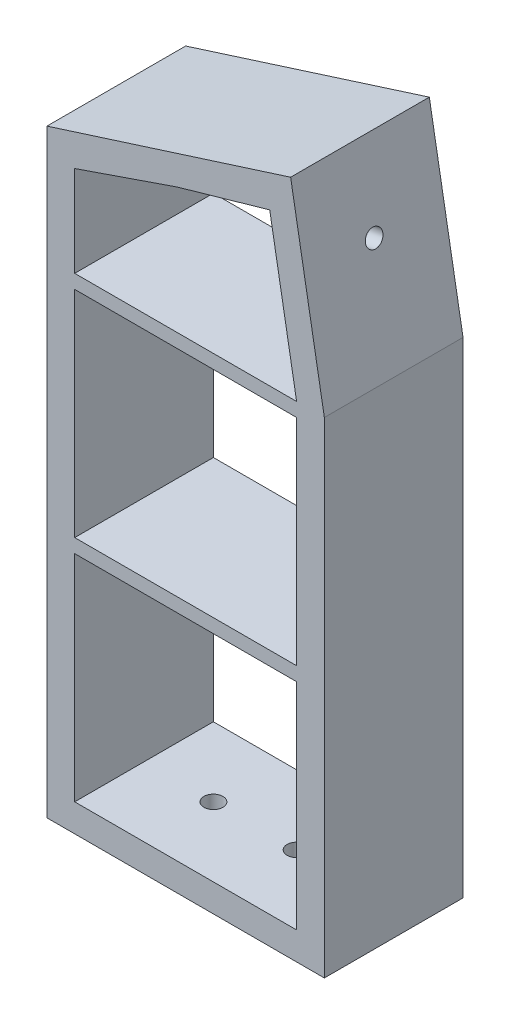
ISO-10303-21;
HEADER;
FILE_DESCRIPTION(('STEP AP214'),'2;1');
FILE_NAME('part.step','',(''),(''),'','','');
FILE_SCHEMA(('AUTOMOTIVE_DESIGN { 1 0 10303 214 1 1 1 1 }'));
ENDSEC;
DATA;
#1=APPLICATION_CONTEXT('core data for automotive mechanical design processes');
#2=APPLICATION_PROTOCOL_DEFINITION('international standard','automotive_design',2000,#1);
#3=PRODUCT_CONTEXT('',#1,'mechanical');
#4=PRODUCT('Part','Part','',(#3));
#5=PRODUCT_RELATED_PRODUCT_CATEGORY('part','',(#4));
#6=PRODUCT_DEFINITION_FORMATION('','',#4);
#7=PRODUCT_DEFINITION_CONTEXT('part definition',#1,'design');
#8=PRODUCT_DEFINITION('design','',#6,#7);
#9=PRODUCT_DEFINITION_SHAPE('','',#8);
#10=(LENGTH_UNIT() NAMED_UNIT(*) SI_UNIT(.MILLI.,.METRE.));
#11=(NAMED_UNIT(*) PLANE_ANGLE_UNIT() SI_UNIT($,.RADIAN.));
#12=(NAMED_UNIT(*) SI_UNIT($,.STERADIAN.) SOLID_ANGLE_UNIT());
#13=UNCERTAINTY_MEASURE_WITH_UNIT(LENGTH_MEASURE(1.E-05),#10,'distance_accuracy_value','');
#14=(GEOMETRIC_REPRESENTATION_CONTEXT(3) GLOBAL_UNCERTAINTY_ASSIGNED_CONTEXT((#13)) GLOBAL_UNIT_ASSIGNED_CONTEXT((#10,
#11,#12)) REPRESENTATION_CONTEXT('',''));
#15=CARTESIAN_POINT('',(0.,0.,0.));
#16=DIRECTION('',(0.,0.,1.));
#17=DIRECTION('',(1.,0.,0.));
#18=AXIS2_PLACEMENT_3D('',#15,#16,#17);
#19=CARTESIAN_POINT('',(-30.8690259824049,207.731789578758,50.));
#20=DIRECTION('',(1.,0.,0.));
#21=DIRECTION('',(0.,1.,0.));
#22=AXIS2_PLACEMENT_3D('',#19,#20,#21);
#23=PLANE('',#22);
#24=DIRECTION('',(0.,0.,1.));
#25=VECTOR('',#24,1.);
#26=CARTESIAN_POINT('',(-30.8690259824049,175.,0.));
#27=LINE('',#26,#25);
#28=CARTESIAN_POINT('',(-30.8690259824049,175.,0.));
#29=VERTEX_POINT('',#28);
#30=CARTESIAN_POINT('',(-30.8690259824049,175.,50.));
#31=VERTEX_POINT('',#30);
#32=EDGE_CURVE('E682',#29,#31,#27,.T.);
#33=ORIENTED_EDGE('',*,*,#32,.F.);
#34=DIRECTION('',(0.,-1.,0.));
#35=VECTOR('',#34,1.);
#36=CARTESIAN_POINT('',(-30.8690259824049,207.731789578758,0.));
#37=LINE('',#36,#35);
#38=CARTESIAN_POINT('',(-30.8690259824049,207.731789578758,0.));
#39=VERTEX_POINT('',#38);
#40=EDGE_CURVE('E296',#39,#29,#37,.T.);
#41=ORIENTED_EDGE('',*,*,#40,.F.);
#42=DIRECTION('',(0.,0.,-1.));
#43=VECTOR('',#42,1.);
#44=CARTESIAN_POINT('',(-30.8690259824049,207.731789578758,50.));
#45=LINE('',#44,#43);
#46=CARTESIAN_POINT('',(-30.8690259824049,207.731789578758,50.));
#47=VERTEX_POINT('',#46);
#48=EDGE_CURVE('E273',#47,#39,#45,.T.);
#49=ORIENTED_EDGE('',*,*,#48,.F.);
#50=DIRECTION('',(0.,-1.,0.));
#51=VECTOR('',#50,1.);
#52=CARTESIAN_POINT('',(-30.8690259824049,107.98972636841,50.));
#53=LINE('',#52,#51);
#54=EDGE_CURVE('E180',#47,#31,#53,.T.);
#55=ORIENTED_EDGE('',*,*,#54,.T.);
#56=EDGE_LOOP('',(#33,#41,#49,#55));
#57=FACE_BOUND('',#56,.T.);
#58=ADVANCED_FACE('F43',(#57),#23,.T.);
#59=CARTESIAN_POINT('',(49.130974017595,87.5,50.));
#60=DIRECTION('',(-1.,0.,0.));
#61=DIRECTION('',(0.,0.,1.));
#62=AXIS2_PLACEMENT_3D('',#59,#60,#61);
#63=PLANE('',#62);
#64=DIRECTION('',(0.,0.,1.));
#65=VECTOR('',#64,1.);
#66=CARTESIAN_POINT('',(49.130974017595,87.5,0.));
#67=LINE('',#66,#65);
#68=CARTESIAN_POINT('',(49.130974017595,87.5,0.));
#69=VERTEX_POINT('',#68);
#70=CARTESIAN_POINT('',(49.130974017595,87.5,50.));
#71=VERTEX_POINT('',#70);
#72=EDGE_CURVE('E223',#69,#71,#67,.T.);
#73=ORIENTED_EDGE('',*,*,#72,.F.);
#74=DIRECTION('',(0.,1.,0.));
#75=VECTOR('',#74,1.);
#76=CARTESIAN_POINT('',(49.130974017595,87.5,0.));
#77=LINE('',#76,#75);
#78=CARTESIAN_POINT('',(49.130974017595,10.,0.));
#79=VERTEX_POINT('',#78);
#80=EDGE_CURVE('E279',#79,#69,#77,.T.);
#81=ORIENTED_EDGE('',*,*,#80,.F.);
#82=DIRECTION('',(0.,0.,-1.));
#83=VECTOR('',#82,1.);
#84=CARTESIAN_POINT('',(49.130974017595,10.,50.));
#85=LINE('',#84,#83);
#86=CARTESIAN_POINT('',(49.130974017595,10.,50.));
#87=VERTEX_POINT('',#86);
#88=EDGE_CURVE('E312',#87,#79,#85,.T.);
#89=ORIENTED_EDGE('',*,*,#88,.F.);
#90=DIRECTION('',(0.,1.,0.));
#91=VECTOR('',#90,1.);
#92=CARTESIAN_POINT('',(49.130974017595,10.,50.));
#93=LINE('',#92,#91);
#94=EDGE_CURVE('E260',#87,#71,#93,.T.);
#95=ORIENTED_EDGE('',*,*,#94,.T.);
#96=EDGE_LOOP('',(#73,#81,#89,#95));
#97=FACE_BOUND('',#96,.T.);
#98=ADVANCED_FACE('F402',(#97),#63,.T.);
#99=DIRECTION('',(0.,0.,1.));
#100=VECTOR('',#99,1.);
#101=CARTESIAN_POINT('',(-30.8690259824049,87.5,0.));
#102=LINE('',#101,#100);
#103=CARTESIAN_POINT('',(-30.8690259824049,87.5,0.));
#104=VERTEX_POINT('',#103);
#105=CARTESIAN_POINT('',(-30.8690259824049,87.5,50.));
#106=VERTEX_POINT('',#105);
#107=EDGE_CURVE('E228',#104,#106,#102,.T.);
#108=ORIENTED_EDGE('',*,*,#107,.T.);
#109=CARTESIAN_POINT('',(-30.869025982405,10.,50.));
#110=VERTEX_POINT('',#109);
#111=EDGE_CURVE('E181',#106,#110,#53,.T.);
#112=ORIENTED_EDGE('',*,*,#111,.T.);
#113=DIRECTION('',(0.,0.,-1.));
#114=VECTOR('',#113,1.);
#115=CARTESIAN_POINT('',(-30.869025982405,10.,50.));
#116=LINE('',#115,#114);
#117=CARTESIAN_POINT('',(-30.8690259824049,10.,0.));
#118=VERTEX_POINT('',#117);
#119=EDGE_CURVE('E316',#110,#118,#116,.T.);
#120=ORIENTED_EDGE('',*,*,#119,.T.);
#121=EDGE_CURVE('E295',#104,#118,#37,.T.);
#122=ORIENTED_EDGE('',*,*,#121,.F.);
#123=EDGE_LOOP('',(#108,#112,#120,#122));
#124=FACE_BOUND('',#123,.T.);
#125=ADVANCED_FACE('F405',(#124),#23,.T.);
#126=CARTESIAN_POINT('',(0.,0.,50.));
#127=DIRECTION('',(0.,0.,1.));
#128=DIRECTION('',(1.,0.,0.));
#129=AXIS2_PLACEMENT_3D('',#126,#127,#128);
#130=PLANE('',#129);
#131=DIRECTION('',(-0.173648177666931,0.984807753012208,0.));
#132=VECTOR('',#131,1.);
#133=CARTESIAN_POINT('',(49.130974017595,175.,50.));
#134=LINE('',#133,#132);
#135=CARTESIAN_POINT('',(49.130974017595,175.,50.));
#136=VERTEX_POINT('',#135);
#137=CARTESIAN_POINT('',(39.440396213168,229.957997723837,50.));
#138=VERTEX_POINT('',#137);
#139=EDGE_CURVE('E263',#136,#138,#134,.T.);
#140=ORIENTED_EDGE('',*,*,#139,.F.);
#141=DIRECTION('',(-1.,0.,0.));
#142=VECTOR('',#141,1.);
#143=CARTESIAN_POINT('',(49.130974017595,175.,50.));
#144=LINE('',#143,#142);
#145=EDGE_CURVE('E195',#136,#31,#144,.T.);
#146=ORIENTED_EDGE('',*,*,#145,.T.);
#147=ORIENTED_EDGE('',*,*,#54,.F.);
#148=DIRECTION('',(-0.945734769141537,-0.324939604291019,0.));
#149=VECTOR('',#148,1.);
#150=CARTESIAN_POINT('',(6.08596726535605,220.428944504557,50.));
#151=LINE('',#150,#149);
#152=CARTESIAN_POINT('',(6.08596726535605,220.428944504557,50.));
#153=VERTEX_POINT('',#152);
#154=EDGE_CURVE('E269',#153,#47,#151,.T.);
#155=ORIENTED_EDGE('',*,*,#154,.F.);
#156=DIRECTION('',(-0.961529914586664,-0.274700242728255,0.));
#157=VECTOR('',#156,1.);
#158=CARTESIAN_POINT('',(39.440396213168,229.957997723837,50.));
#159=LINE('',#158,#157);
#160=EDGE_CURVE('E266',#138,#153,#159,.T.);
#161=ORIENTED_EDGE('',*,*,#160,.F.);
#162=EDGE_LOOP('',(#140,#146,#147,#155,#161));
#163=FACE_BOUND('',#162,.T.);
#164=CARTESIAN_POINT('',(49.130974017595,92.5,50.));
#165=VERTEX_POINT('',#164);
#166=CARTESIAN_POINT('',(49.1309740175949,170.,50.));
#167=VERTEX_POINT('',#166);
#168=EDGE_CURVE('E65',#165,#167,#93,.T.);
#169=ORIENTED_EDGE('',*,*,#168,.F.);
#170=DIRECTION('',(-1.,0.,0.));
#171=VECTOR('',#170,1.);
#172=CARTESIAN_POINT('',(49.130974017595,92.5,50.));
#173=LINE('',#172,#171);
#174=CARTESIAN_POINT('',(-30.8690259824049,92.5,50.));
#175=VERTEX_POINT('',#174);
#176=EDGE_CURVE('E175',#165,#175,#173,.T.);
#177=ORIENTED_EDGE('',*,*,#176,.T.);
#178=CARTESIAN_POINT('',(-30.8690259824049,170.,50.));
#179=VERTEX_POINT('',#178);
#180=EDGE_CURVE('E168',#179,#175,#53,.T.);
#181=ORIENTED_EDGE('',*,*,#180,.F.);
#182=DIRECTION('',(1.,0.,0.));
#183=VECTOR('',#182,1.);
#184=CARTESIAN_POINT('',(49.130974017595,170.,50.));
#185=LINE('',#184,#183);
#186=EDGE_CURVE('E173',#179,#167,#185,.T.);
#187=ORIENTED_EDGE('',*,*,#186,.T.);
#188=EDGE_LOOP('',(#169,#177,#181,#187));
#189=FACE_BOUND('',#188,.T.);
#190=DIRECTION('',(-0.173648177666931,0.984807753012208,0.));
#191=VECTOR('',#190,1.);
#192=CARTESIAN_POINT('',(59.130974017595,175.,50.));
#193=LINE('',#192,#191);
#194=CARTESIAN_POINT('',(59.130974017595,175.,50.));
#195=VERTEX_POINT('',#194);
#196=CARTESIAN_POINT('',(46.9756015809098,243.936542710855,50.));
#197=VERTEX_POINT('',#196);
#198=EDGE_CURVE('E321',#195,#197,#193,.T.);
#199=ORIENTED_EDGE('',*,*,#198,.T.);
#200=DIRECTION('',(-0.952905321928016,-0.30326794661036,0.));
#201=VECTOR('',#200,1.);
#202=CARTESIAN_POINT('',(46.9756015809098,243.936542710855,50.));
#203=LINE('',#202,#201);
#204=CARTESIAN_POINT('',(-40.869025982405,215.97945273682,50.));
#205=VERTEX_POINT('',#204);
#206=EDGE_CURVE('E325',#197,#205,#203,.T.);
#207=ORIENTED_EDGE('',*,*,#206,.T.);
#208=DIRECTION('',(0.,-1.,0.));
#209=VECTOR('',#208,1.);
#210=CARTESIAN_POINT('',(-40.869025982405,215.97945273682,50.));
#211=LINE('',#210,#209);
#212=CARTESIAN_POINT('',(-40.869025982405,0.,50.));
#213=VERTEX_POINT('',#212);
#214=EDGE_CURVE('E329',#205,#213,#211,.T.);
#215=ORIENTED_EDGE('',*,*,#214,.T.);
#216=DIRECTION('',(1.,0.,0.));
#217=VECTOR('',#216,1.);
#218=CARTESIAN_POINT('',(-40.869025982405,0.,50.));
#219=LINE('',#218,#217);
#220=CARTESIAN_POINT('',(59.130974017595,0.,50.));
#221=VERTEX_POINT('',#220);
#222=EDGE_CURVE('E332',#213,#221,#219,.T.);
#223=ORIENTED_EDGE('',*,*,#222,.T.);
#224=DIRECTION('',(0.,1.,0.));
#225=VECTOR('',#224,1.);
#226=CARTESIAN_POINT('',(59.130974017595,0.,50.));
#227=LINE('',#226,#225);
#228=EDGE_CURVE('E335',#221,#195,#227,.T.);
#229=ORIENTED_EDGE('',*,*,#228,.T.);
#230=EDGE_LOOP('',(#199,#207,#215,#223,#229));
#231=FACE_BOUND('',#230,.T.);
#232=ORIENTED_EDGE('',*,*,#94,.F.);
#233=DIRECTION('',(1.,0.,0.));
#234=VECTOR('',#233,1.);
#235=CARTESIAN_POINT('',(-30.869025982405,10.,50.));
#236=LINE('',#235,#234);
#237=EDGE_CURVE('E257',#110,#87,#236,.T.);
#238=ORIENTED_EDGE('',*,*,#237,.F.);
#239=ORIENTED_EDGE('',*,*,#111,.F.);
#240=DIRECTION('',(1.,0.,0.));
#241=VECTOR('',#240,1.);
#242=CARTESIAN_POINT('',(49.130974017595,87.5,50.));
#243=LINE('',#242,#241);
#244=EDGE_CURVE('E199',#106,#71,#243,.T.);
#245=ORIENTED_EDGE('',*,*,#244,.T.);
#246=EDGE_LOOP('',(#232,#238,#239,#245));
#247=FACE_BOUND('',#246,.T.);
#248=ADVANCED_FACE('F170',(#163,#189,#231,#247),#130,.T.);
#249=CARTESIAN_POINT('',(0.,0.,0.));
#250=DIRECTION('',(0.,0.,1.));
#251=DIRECTION('',(1.,0.,0.));
#252=AXIS2_PLACEMENT_3D('',#249,#250,#251);
#253=PLANE('',#252);
#254=DIRECTION('',(-1.,0.,0.));
#255=VECTOR('',#254,1.);
#256=CARTESIAN_POINT('',(49.130974017595,175.,0.));
#257=LINE('',#256,#255);
#258=CARTESIAN_POINT('',(49.130974017595,175.,0.));
#259=VERTEX_POINT('',#258);
#260=EDGE_CURVE('E191',#259,#29,#257,.T.);
#261=ORIENTED_EDGE('',*,*,#260,.F.);
#262=DIRECTION('',(-0.173648177666931,0.984807753012208,0.));
#263=VECTOR('',#262,1.);
#264=CARTESIAN_POINT('',(49.130974017595,175.,0.));
#265=LINE('',#264,#263);
#266=CARTESIAN_POINT('',(39.440396213168,229.957997723837,0.));
#267=VERTEX_POINT('',#266);
#268=EDGE_CURVE('E283',#259,#267,#265,.T.);
#269=ORIENTED_EDGE('',*,*,#268,.T.);
#270=DIRECTION('',(-0.961529914586664,-0.274700242728255,0.));
#271=VECTOR('',#270,1.);
#272=CARTESIAN_POINT('',(39.440396213168,229.957997723837,0.));
#273=LINE('',#272,#271);
#274=CARTESIAN_POINT('',(6.08596726535605,220.428944504557,0.));
#275=VERTEX_POINT('',#274);
#276=EDGE_CURVE('E287',#267,#275,#273,.T.);
#277=ORIENTED_EDGE('',*,*,#276,.T.);
#278=DIRECTION('',(-0.945734769141537,-0.324939604291019,0.));
#279=VECTOR('',#278,1.);
#280=CARTESIAN_POINT('',(6.08596726535605,220.428944504557,0.));
#281=LINE('',#280,#279);
#282=EDGE_CURVE('E291',#275,#39,#281,.T.);
#283=ORIENTED_EDGE('',*,*,#282,.T.);
#284=ORIENTED_EDGE('',*,*,#40,.T.);
#285=EDGE_LOOP('',(#261,#269,#277,#283,#284));
#286=FACE_BOUND('',#285,.T.);
#287=DIRECTION('',(-1.,0.,0.));
#288=VECTOR('',#287,1.);
#289=CARTESIAN_POINT('',(49.130974017595,92.5,0.));
#290=LINE('',#289,#288);
#291=CARTESIAN_POINT('',(49.130974017595,92.5,0.));
#292=VERTEX_POINT('',#291);
#293=CARTESIAN_POINT('',(-30.8690259824049,92.5,0.));
#294=VERTEX_POINT('',#293);
#295=EDGE_CURVE('E211',#292,#294,#290,.T.);
#296=ORIENTED_EDGE('',*,*,#295,.F.);
#297=CARTESIAN_POINT('',(49.130974017595,170.,0.));
#298=VERTEX_POINT('',#297);
#299=EDGE_CURVE('E278',#292,#298,#77,.T.);
#300=ORIENTED_EDGE('',*,*,#299,.T.);
#301=DIRECTION('',(1.,0.,0.));
#302=VECTOR('',#301,1.);
#303=CARTESIAN_POINT('',(49.130974017595,170.,0.));
#304=LINE('',#303,#302);
#305=CARTESIAN_POINT('',(-30.8690259824049,170.,0.));
#306=VERTEX_POINT('',#305);
#307=EDGE_CURVE('E202',#306,#298,#304,.T.);
#308=ORIENTED_EDGE('',*,*,#307,.F.);
#309=EDGE_CURVE('E186',#306,#294,#37,.T.);
#310=ORIENTED_EDGE('',*,*,#309,.T.);
#311=EDGE_LOOP('',(#296,#300,#308,#310));
#312=FACE_BOUND('',#311,.T.);
#313=DIRECTION('',(-0.173648177666931,0.984807753012208,0.));
#314=VECTOR('',#313,1.);
#315=CARTESIAN_POINT('',(59.130974017595,175.,0.));
#316=LINE('',#315,#314);
#317=CARTESIAN_POINT('',(59.130974017595,175.,0.));
#318=VERTEX_POINT('',#317);
#319=CARTESIAN_POINT('',(46.9756015809098,243.936542710855,0.));
#320=VERTEX_POINT('',#319);
#321=EDGE_CURVE('E320',#318,#320,#316,.T.);
#322=ORIENTED_EDGE('',*,*,#321,.F.);
#323=DIRECTION('',(0.,1.,0.));
#324=VECTOR('',#323,1.);
#325=CARTESIAN_POINT('',(59.130974017595,0.,0.));
#326=LINE('',#325,#324);
#327=CARTESIAN_POINT('',(59.130974017595,0.,0.));
#328=VERTEX_POINT('',#327);
#329=EDGE_CURVE('E326',#328,#318,#326,.T.);
#330=ORIENTED_EDGE('',*,*,#329,.F.);
#331=DIRECTION('',(1.,0.,0.));
#332=VECTOR('',#331,1.);
#333=CARTESIAN_POINT('',(-40.869025982405,0.,0.));
#334=LINE('',#333,#332);
#335=CARTESIAN_POINT('',(-40.869025982405,0.,0.));
#336=VERTEX_POINT('',#335);
#337=EDGE_CURVE('E348',#336,#328,#334,.T.);
#338=ORIENTED_EDGE('',*,*,#337,.F.);
#339=DIRECTION('',(0.,-1.,0.));
#340=VECTOR('',#339,1.);
#341=CARTESIAN_POINT('',(-40.869025982405,215.97945273682,0.));
#342=LINE('',#341,#340);
#343=CARTESIAN_POINT('',(-40.869025982405,215.97945273682,0.));
#344=VERTEX_POINT('',#343);
#345=EDGE_CURVE('E345',#344,#336,#342,.T.);
#346=ORIENTED_EDGE('',*,*,#345,.F.);
#347=DIRECTION('',(-0.952905321928016,-0.30326794661036,0.));
#348=VECTOR('',#347,1.);
#349=CARTESIAN_POINT('',(46.9756015809098,243.936542710855,0.));
#350=LINE('',#349,#348);
#351=EDGE_CURVE('E342',#320,#344,#350,.T.);
#352=ORIENTED_EDGE('',*,*,#351,.F.);
#353=EDGE_LOOP('',(#322,#330,#338,#346,#352));
#354=FACE_BOUND('',#353,.T.);
#355=DIRECTION('',(1.,0.,0.));
#356=VECTOR('',#355,1.);
#357=CARTESIAN_POINT('',(0.,10.,0.));
#358=LINE('',#357,#356);
#359=EDGE_CURVE('E274',#118,#79,#358,.T.);
#360=ORIENTED_EDGE('',*,*,#359,.T.);
#361=ORIENTED_EDGE('',*,*,#80,.T.);
#362=DIRECTION('',(1.,0.,0.));
#363=VECTOR('',#362,1.);
#364=CARTESIAN_POINT('',(49.130974017595,87.5,0.));
#365=LINE('',#364,#363);
#366=EDGE_CURVE('E215',#104,#69,#365,.T.);
#367=ORIENTED_EDGE('',*,*,#366,.F.);
#368=ORIENTED_EDGE('',*,*,#121,.T.);
#369=EDGE_LOOP('',(#360,#361,#367,#368));
#370=FACE_BOUND('',#369,.T.);
#371=ADVANCED_FACE('F376',(#286,#312,#354,#370),#253,.F.);
#372=CARTESIAN_POINT('',(59.130974017595,175.,50.));
#373=DIRECTION('',(-0.984807753012208,-0.173648177666931,0.));
#374=DIRECTION('',(0.173648177666931,-0.984807753012208,0.));
#375=AXIS2_PLACEMENT_3D('',#372,#373,#374);
#376=PLANE('',#375);
#377=CARTESIAN_POINT('',(52.0779059852973,214.999936504097,25.));
#378=DIRECTION('',(0.984807753012208,0.173648177666931,0.));
#379=DIRECTION('',(-0.173648177666931,0.984807753012208,0.));
#380=AXIS2_PLACEMENT_3D('',#377,#378,#379);
#381=CIRCLE('',#380,3.15);
#382=CARTESIAN_POINT('',(51.5309142256464,218.102080926085,25.));
#383=VERTEX_POINT('',#382);
#384=EDGE_CURVE('E241',#383,#383,#381,.T.);
#385=ORIENTED_EDGE('',*,*,#384,.F.);
#386=EDGE_LOOP('',(#385));
#387=FACE_BOUND('',#386,.T.);
#388=ORIENTED_EDGE('',*,*,#321,.T.);
#389=DIRECTION('',(0.,0.,-1.));
#390=VECTOR('',#389,1.);
#391=CARTESIAN_POINT('',(46.9756015809098,243.936542710855,50.));
#392=LINE('',#391,#390);
#393=EDGE_CURVE('E11',#197,#320,#392,.T.);
#394=ORIENTED_EDGE('',*,*,#393,.F.);
#395=ORIENTED_EDGE('',*,*,#198,.F.);
#396=DIRECTION('',(0.,0.,-1.));
#397=VECTOR('',#396,1.);
#398=CARTESIAN_POINT('',(59.130974017595,175.,50.));
#399=LINE('',#398,#397);
#400=EDGE_CURVE('E338',#195,#318,#399,.T.);
#401=ORIENTED_EDGE('',*,*,#400,.T.);
#402=EDGE_LOOP('',(#388,#394,#395,#401));
#403=FACE_BOUND('',#402,.T.);
#404=ADVANCED_FACE('F45',(#387,#403),#376,.F.);
#405=CARTESIAN_POINT('',(46.9756015809098,243.936542710855,50.));
#406=DIRECTION('',(0.30326794661036,-0.952905321928016,0.));
#407=DIRECTION('',(0.952905321928016,0.30326794661036,0.));
#408=AXIS2_PLACEMENT_3D('',#405,#406,#407);
#409=PLANE('',#408);
#410=ORIENTED_EDGE('',*,*,#351,.T.);
#411=DIRECTION('',(0.,0.,-1.));
#412=VECTOR('',#411,1.);
#413=CARTESIAN_POINT('',(-40.869025982405,215.97945273682,50.));
#414=LINE('',#413,#412);
#415=EDGE_CURVE('E53',#205,#344,#414,.T.);
#416=ORIENTED_EDGE('',*,*,#415,.F.);
#417=ORIENTED_EDGE('',*,*,#206,.F.);
#418=ORIENTED_EDGE('',*,*,#393,.T.);
#419=EDGE_LOOP('',(#410,#416,#417,#418));
#420=FACE_BOUND('',#419,.T.);
#421=ADVANCED_FACE('F390',(#420),#409,.F.);
#422=CARTESIAN_POINT('',(-40.869025982405,215.97945273682,50.));
#423=DIRECTION('',(1.,0.,0.));
#424=DIRECTION('',(0.,1.,0.));
#425=AXIS2_PLACEMENT_3D('',#422,#423,#424);
#426=PLANE('',#425);
#427=ORIENTED_EDGE('',*,*,#345,.T.);
#428=DIRECTION('',(0.,0.,-1.));
#429=VECTOR('',#428,1.);
#430=CARTESIAN_POINT('',(-40.869025982405,0.,50.));
#431=LINE('',#430,#429);
#432=EDGE_CURVE('E360',#213,#336,#431,.T.);
#433=ORIENTED_EDGE('',*,*,#432,.F.);
#434=ORIENTED_EDGE('',*,*,#214,.F.);
#435=ORIENTED_EDGE('',*,*,#415,.T.);
#436=EDGE_LOOP('',(#427,#433,#434,#435));
#437=FACE_BOUND('',#436,.T.);
#438=ADVANCED_FACE('F370',(#437),#426,.F.);
#439=CARTESIAN_POINT('',(-40.869025982405,0.,50.));
#440=DIRECTION('',(0.,1.,0.));
#441=DIRECTION('',(-1.,0.,0.));
#442=AXIS2_PLACEMENT_3D('',#439,#440,#441);
#443=PLANE('',#442);
#444=CARTESIAN_POINT('',(-5.85128713251137,0.,25.));
#445=DIRECTION('',(0.,1.,0.));
#446=DIRECTION('',(0.,0.,1.));
#447=AXIS2_PLACEMENT_3D('',#444,#445,#446);
#448=CIRCLE('',#447,3.425);
#449=CARTESIAN_POINT('',(-5.85128713251137,0.,28.425));
#450=VERTEX_POINT('',#449);
#451=EDGE_CURVE('E237',#450,#450,#448,.T.);
#452=ORIENTED_EDGE('',*,*,#451,.T.);
#453=EDGE_LOOP('',(#452));
#454=FACE_BOUND('',#453,.T.);
#455=CARTESIAN_POINT('',(24.130974017595,0.,25.));
#456=DIRECTION('',(0.,1.,0.));
#457=DIRECTION('',(0.,0.,1.));
#458=AXIS2_PLACEMENT_3D('',#455,#456,#457);
#459=CIRCLE('',#458,3.425);
#460=CARTESIAN_POINT('',(24.130974017595,0.,28.425));
#461=VERTEX_POINT('',#460);
#462=EDGE_CURVE('E227',#461,#461,#459,.T.);
#463=ORIENTED_EDGE('',*,*,#462,.T.);
#464=EDGE_LOOP('',(#463));
#465=FACE_BOUND('',#464,.T.);
#466=ORIENTED_EDGE('',*,*,#337,.T.);
#467=DIRECTION('',(0.,0.,-1.));
#468=VECTOR('',#467,1.);
#469=CARTESIAN_POINT('',(59.130974017595,0.,50.));
#470=LINE('',#469,#468);
#471=EDGE_CURVE('E356',#221,#328,#470,.T.);
#472=ORIENTED_EDGE('',*,*,#471,.F.);
#473=ORIENTED_EDGE('',*,*,#222,.F.);
#474=ORIENTED_EDGE('',*,*,#432,.T.);
#475=EDGE_LOOP('',(#466,#472,#473,#474));
#476=FACE_BOUND('',#475,.T.);
#477=ADVANCED_FACE('F381',(#454,#465,#476),#443,.F.);
#478=CARTESIAN_POINT('',(59.130974017595,0.,50.));
#479=DIRECTION('',(-1.,0.,0.));
#480=DIRECTION('',(0.,-1.,0.));
#481=AXIS2_PLACEMENT_3D('',#478,#479,#480);
#482=PLANE('',#481);
#483=ORIENTED_EDGE('',*,*,#329,.T.);
#484=ORIENTED_EDGE('',*,*,#400,.F.);
#485=ORIENTED_EDGE('',*,*,#228,.F.);
#486=ORIENTED_EDGE('',*,*,#471,.T.);
#487=EDGE_LOOP('',(#483,#484,#485,#486));
#488=FACE_BOUND('',#487,.T.);
#489=ADVANCED_FACE('F385',(#488),#482,.F.);
#490=CARTESIAN_POINT('',(0.,10.,50.));
#491=DIRECTION('',(0.,1.,0.));
#492=DIRECTION('',(0.,0.,1.));
#493=AXIS2_PLACEMENT_3D('',#490,#491,#492);
#494=PLANE('',#493);
#495=CARTESIAN_POINT('',(-5.85128713251137,10.,25.));
#496=DIRECTION('',(0.,1.,0.));
#497=DIRECTION('',(0.,0.,1.));
#498=AXIS2_PLACEMENT_3D('',#495,#496,#497);
#499=CIRCLE('',#498,3.425);
#500=CARTESIAN_POINT('',(-5.85128713251137,10.,28.425));
#501=VERTEX_POINT('',#500);
#502=EDGE_CURVE('E242',#501,#501,#499,.T.);
#503=ORIENTED_EDGE('',*,*,#502,.F.);
#504=EDGE_LOOP('',(#503));
#505=FACE_BOUND('',#504,.T.);
#506=CARTESIAN_POINT('',(24.130974017595,10.,25.));
#507=DIRECTION('',(0.,1.,0.));
#508=DIRECTION('',(0.,0.,1.));
#509=AXIS2_PLACEMENT_3D('',#506,#507,#508);
#510=CIRCLE('',#509,3.425);
#511=CARTESIAN_POINT('',(24.130974017595,10.,28.425));
#512=VERTEX_POINT('',#511);
#513=EDGE_CURVE('E246',#512,#512,#510,.T.);
#514=ORIENTED_EDGE('',*,*,#513,.F.);
#515=EDGE_LOOP('',(#514));
#516=FACE_BOUND('',#515,.T.);
#517=ORIENTED_EDGE('',*,*,#359,.F.);
#518=ORIENTED_EDGE('',*,*,#119,.F.);
#519=ORIENTED_EDGE('',*,*,#237,.T.);
#520=ORIENTED_EDGE('',*,*,#88,.T.);
#521=EDGE_LOOP('',(#517,#518,#519,#520));
#522=FACE_BOUND('',#521,.T.);
#523=ADVANCED_FACE('F439',(#505,#516,#522),#494,.T.);
#524=DIRECTION('',(0.,0.,1.));
#525=VECTOR('',#524,1.);
#526=CARTESIAN_POINT('',(49.130974017595,170.,0.));
#527=LINE('',#526,#525);
#528=EDGE_CURVE('E60',#298,#167,#527,.T.);
#529=ORIENTED_EDGE('',*,*,#528,.F.);
#530=ORIENTED_EDGE('',*,*,#299,.F.);
#531=DIRECTION('',(0.,0.,1.));
#532=VECTOR('',#531,1.);
#533=CARTESIAN_POINT('',(49.130974017595,92.5,0.));
#534=LINE('',#533,#532);
#535=EDGE_CURVE('E218',#292,#165,#534,.T.);
#536=ORIENTED_EDGE('',*,*,#535,.T.);
#537=ORIENTED_EDGE('',*,*,#168,.T.);
#538=EDGE_LOOP('',(#529,#530,#536,#537));
#539=FACE_BOUND('',#538,.T.);
#540=ADVANCED_FACE('F411',(#539),#63,.T.);
#541=CARTESIAN_POINT('',(49.130974017595,175.,50.));
#542=DIRECTION('',(-0.984807753012208,-0.173648177666931,0.));
#543=DIRECTION('',(0.173648177666931,-0.984807753012208,0.));
#544=AXIS2_PLACEMENT_3D('',#541,#542,#543);
#545=PLANE('',#544);
#546=CARTESIAN_POINT('',(42.3794428813677,213.289835787468,25.));
#547=DIRECTION('',(-0.984807753012208,-0.173648177666931,0.));
#548=DIRECTION('',(0.173648177666931,-0.984807753012208,0.));
#549=AXIS2_PLACEMENT_3D('',#546,#547,#548);
#550=CIRCLE('',#549,3.15);
#551=CARTESIAN_POINT('',(42.9264346410185,210.18769136548,25.));
#552=VERTEX_POINT('',#551);
#553=EDGE_CURVE('E47',#552,#552,#550,.T.);
#554=ORIENTED_EDGE('',*,*,#553,.F.);
#555=EDGE_LOOP('',(#554));
#556=FACE_BOUND('',#555,.T.);
#557=ORIENTED_EDGE('',*,*,#268,.F.);
#558=DIRECTION('',(0.,0.,-1.));
#559=VECTOR('',#558,1.);
#560=CARTESIAN_POINT('',(49.130974017595,175.,50.));
#561=LINE('',#560,#559);
#562=EDGE_CURVE('E308',#136,#259,#561,.T.);
#563=ORIENTED_EDGE('',*,*,#562,.F.);
#564=ORIENTED_EDGE('',*,*,#139,.T.);
#565=DIRECTION('',(0.,0.,-1.));
#566=VECTOR('',#565,1.);
#567=CARTESIAN_POINT('',(39.440396213168,229.957997723837,50.));
#568=LINE('',#567,#566);
#569=EDGE_CURVE('E305',#138,#267,#568,.T.);
#570=ORIENTED_EDGE('',*,*,#569,.T.);
#571=EDGE_LOOP('',(#557,#563,#564,#570));
#572=FACE_BOUND('',#571,.T.);
#573=ADVANCED_FACE('F430',(#556,#572),#545,.T.);
#574=CARTESIAN_POINT('',(39.440396213168,229.957997723837,50.));
#575=DIRECTION('',(0.274700242728255,-0.961529914586664,0.));
#576=DIRECTION('',(0.961529914586664,0.274700242728255,0.));
#577=AXIS2_PLACEMENT_3D('',#574,#575,#576);
#578=PLANE('',#577);
#579=ORIENTED_EDGE('',*,*,#276,.F.);
#580=ORIENTED_EDGE('',*,*,#569,.F.);
#581=ORIENTED_EDGE('',*,*,#160,.T.);
#582=DIRECTION('',(0.,0.,-1.));
#583=VECTOR('',#582,1.);
#584=CARTESIAN_POINT('',(6.08596726535605,220.428944504557,50.));
#585=LINE('',#584,#583);
#586=EDGE_CURVE('E302',#153,#275,#585,.T.);
#587=ORIENTED_EDGE('',*,*,#586,.T.);
#588=EDGE_LOOP('',(#579,#580,#581,#587));
#589=FACE_BOUND('',#588,.T.);
#590=ADVANCED_FACE('F425',(#589),#578,.T.);
#591=CARTESIAN_POINT('',(6.08596726535605,220.428944504557,50.));
#592=DIRECTION('',(0.324939604291019,-0.945734769141537,0.));
#593=DIRECTION('',(0.945734769141537,0.324939604291019,0.));
#594=AXIS2_PLACEMENT_3D('',#591,#592,#593);
#595=PLANE('',#594);
#596=ORIENTED_EDGE('',*,*,#282,.F.);
#597=ORIENTED_EDGE('',*,*,#586,.F.);
#598=ORIENTED_EDGE('',*,*,#154,.T.);
#599=ORIENTED_EDGE('',*,*,#48,.T.);
#600=EDGE_LOOP('',(#596,#597,#598,#599));
#601=FACE_BOUND('',#600,.T.);
#602=ADVANCED_FACE('F418',(#601),#595,.T.);
#603=DIRECTION('',(0.,0.,1.));
#604=VECTOR('',#603,1.);
#605=CARTESIAN_POINT('',(-30.8690259824049,170.,0.));
#606=LINE('',#605,#604);
#607=EDGE_CURVE('E184',#306,#179,#606,.T.);
#608=ORIENTED_EDGE('',*,*,#607,.T.);
#609=ORIENTED_EDGE('',*,*,#180,.T.);
#610=DIRECTION('',(0.,0.,1.));
#611=VECTOR('',#610,1.);
#612=CARTESIAN_POINT('',(-30.8690259824049,92.5,0.));
#613=LINE('',#612,#611);
#614=EDGE_CURVE('E232',#294,#175,#613,.T.);
#615=ORIENTED_EDGE('',*,*,#614,.F.);
#616=ORIENTED_EDGE('',*,*,#309,.F.);
#617=EDGE_LOOP('',(#608,#609,#615,#616));
#618=FACE_BOUND('',#617,.T.);
#619=ADVANCED_FACE('F185',(#618),#23,.T.);
#620=CARTESIAN_POINT('',(42.2298284551752,213.263454727428,25.));
#621=DIRECTION('',(0.984807753012208,0.173648177666931,0.));
#622=DIRECTION('',(-0.173648177666931,0.984807753012208,0.));
#623=AXIS2_PLACEMENT_3D('',#620,#621,#622);
#624=CYLINDRICAL_SURFACE('',#623,3.15);
#625=ORIENTED_EDGE('',*,*,#553,.T.);
#626=EDGE_LOOP('',(#625));
#627=FACE_BOUND('',#626,.T.);
#628=ORIENTED_EDGE('',*,*,#384,.T.);
#629=EDGE_LOOP('',(#628));
#630=FACE_BOUND('',#629,.T.);
#631=ADVANCED_FACE('F417',(#627,#630),#624,.F.);
#632=CARTESIAN_POINT('',(24.130974017595,0.,25.));
#633=DIRECTION('',(0.,1.,0.));
#634=DIRECTION('',(0.,0.,1.));
#635=AXIS2_PLACEMENT_3D('',#632,#633,#634);
#636=CYLINDRICAL_SURFACE('',#635,3.425);
#637=ORIENTED_EDGE('',*,*,#462,.F.);
#638=EDGE_LOOP('',(#637));
#639=FACE_BOUND('',#638,.T.);
#640=ORIENTED_EDGE('',*,*,#513,.T.);
#641=EDGE_LOOP('',(#640));
#642=FACE_BOUND('',#641,.T.);
#643=ADVANCED_FACE('F423',(#639,#642),#636,.F.);
#644=CARTESIAN_POINT('',(-5.85128713251137,0.,25.));
#645=DIRECTION('',(0.,1.,0.));
#646=DIRECTION('',(0.,0.,1.));
#647=AXIS2_PLACEMENT_3D('',#644,#645,#646);
#648=CYLINDRICAL_SURFACE('',#647,3.425);
#649=ORIENTED_EDGE('',*,*,#451,.F.);
#650=EDGE_LOOP('',(#649));
#651=FACE_BOUND('',#650,.T.);
#652=ORIENTED_EDGE('',*,*,#502,.T.);
#653=EDGE_LOOP('',(#652));
#654=FACE_BOUND('',#653,.T.);
#655=ADVANCED_FACE('F512',(#651,#654),#648,.F.);
#656=CARTESIAN_POINT('',(49.130974017595,87.5,0.));
#657=DIRECTION('',(0.,-1.,0.));
#658=DIRECTION('',(0.,0.,-1.));
#659=AXIS2_PLACEMENT_3D('',#656,#657,#658);
#660=PLANE('',#659);
#661=ORIENTED_EDGE('',*,*,#244,.F.);
#662=ORIENTED_EDGE('',*,*,#107,.F.);
#663=ORIENTED_EDGE('',*,*,#366,.T.);
#664=ORIENTED_EDGE('',*,*,#72,.T.);
#665=EDGE_LOOP('',(#661,#662,#663,#664));
#666=FACE_BOUND('',#665,.T.);
#667=ADVANCED_FACE('F519',(#666),#660,.T.);
#668=CARTESIAN_POINT('',(49.130974017595,92.5,0.));
#669=DIRECTION('',(0.,1.,0.));
#670=DIRECTION('',(0.,0.,1.));
#671=AXIS2_PLACEMENT_3D('',#668,#669,#670);
#672=PLANE('',#671);
#673=ORIENTED_EDGE('',*,*,#176,.F.);
#674=ORIENTED_EDGE('',*,*,#535,.F.);
#675=ORIENTED_EDGE('',*,*,#295,.T.);
#676=ORIENTED_EDGE('',*,*,#614,.T.);
#677=EDGE_LOOP('',(#673,#674,#675,#676));
#678=FACE_BOUND('',#677,.T.);
#679=ADVANCED_FACE('F527',(#678),#672,.T.);
#680=CARTESIAN_POINT('',(49.130974017595,175.,0.));
#681=DIRECTION('',(0.,1.,0.));
#682=DIRECTION('',(0.,0.,1.));
#683=AXIS2_PLACEMENT_3D('',#680,#681,#682);
#684=PLANE('',#683);
#685=ORIENTED_EDGE('',*,*,#145,.F.);
#686=ORIENTED_EDGE('',*,*,#562,.T.);
#687=ORIENTED_EDGE('',*,*,#260,.T.);
#688=ORIENTED_EDGE('',*,*,#32,.T.);
#689=EDGE_LOOP('',(#685,#686,#687,#688));
#690=FACE_BOUND('',#689,.T.);
#691=ADVANCED_FACE('F535',(#690),#684,.T.);
#692=CARTESIAN_POINT('',(49.130974017595,170.,0.));
#693=DIRECTION('',(0.,-1.,0.));
#694=DIRECTION('',(0.,0.,-1.));
#695=AXIS2_PLACEMENT_3D('',#692,#693,#694);
#696=PLANE('',#695);
#697=ORIENTED_EDGE('',*,*,#186,.F.);
#698=ORIENTED_EDGE('',*,*,#607,.F.);
#699=ORIENTED_EDGE('',*,*,#307,.T.);
#700=ORIENTED_EDGE('',*,*,#528,.T.);
#701=EDGE_LOOP('',(#697,#698,#699,#700));
#702=FACE_BOUND('',#701,.T.);
#703=ADVANCED_FACE('F193',(#702),#696,.T.);
#704=CLOSED_SHELL('',(#58,#98,#125,#248,#371,#404,#421,#438,#477,#489,#523,#540,#573,#590,#602,
#619,#631,#643,#655,#667,#679,#691,#703));
#705=MANIFOLD_SOLID_BREP('B2',#704);
#706=ADVANCED_BREP_SHAPE_REPRESENTATION('',(#18,#705),#14);
#707=SHAPE_DEFINITION_REPRESENTATION(#9,#706);
ENDSEC;
END-ISO-10303-21;
